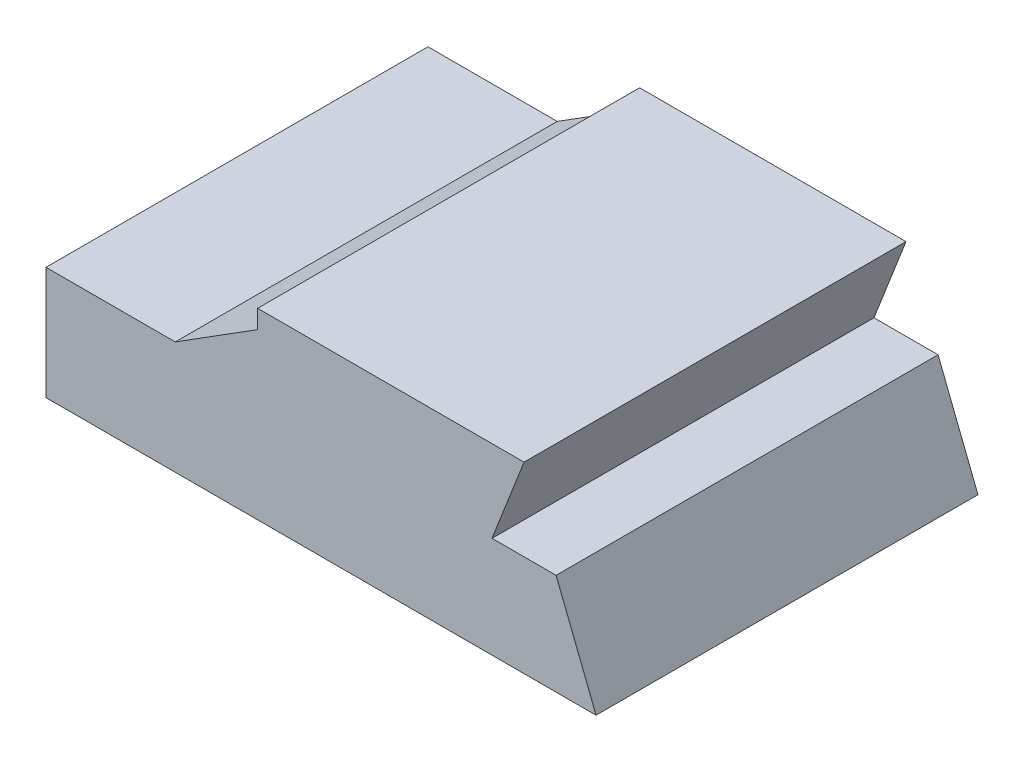
ISO-10303-21;
HEADER;
FILE_DESCRIPTION(('STEP AP214'),'2;1');
FILE_NAME('part.step','',(''),(''),'','','');
FILE_SCHEMA(('AUTOMOTIVE_DESIGN { 1 0 10303 214 1 1 1 1 }'));
ENDSEC;
DATA;
#1=APPLICATION_CONTEXT('core data for automotive mechanical design processes');
#2=APPLICATION_PROTOCOL_DEFINITION('international standard','automotive_design',2000,#1);
#3=PRODUCT_CONTEXT('',#1,'mechanical');
#4=PRODUCT('Part','Part','',(#3));
#5=PRODUCT_RELATED_PRODUCT_CATEGORY('part','',(#4));
#6=PRODUCT_DEFINITION_FORMATION('','',#4);
#7=PRODUCT_DEFINITION_CONTEXT('part definition',#1,'design');
#8=PRODUCT_DEFINITION('design','',#6,#7);
#9=PRODUCT_DEFINITION_SHAPE('','',#8);
#10=(LENGTH_UNIT() NAMED_UNIT(*) SI_UNIT(.MILLI.,.METRE.));
#11=(NAMED_UNIT(*) PLANE_ANGLE_UNIT() SI_UNIT($,.RADIAN.));
#12=(NAMED_UNIT(*) SI_UNIT($,.STERADIAN.) SOLID_ANGLE_UNIT());
#13=UNCERTAINTY_MEASURE_WITH_UNIT(LENGTH_MEASURE(1.E-05),#10,'distance_accuracy_value','');
#14=(GEOMETRIC_REPRESENTATION_CONTEXT(3) GLOBAL_UNCERTAINTY_ASSIGNED_CONTEXT((#13)) GLOBAL_UNIT_ASSIGNED_CONTEXT((#10,
#11,#12)) REPRESENTATION_CONTEXT('',''));
#15=CARTESIAN_POINT('',(0.,0.,0.));
#16=DIRECTION('',(0.,0.,1.));
#17=DIRECTION('',(1.,0.,0.));
#18=AXIS2_PLACEMENT_3D('',#15,#16,#17);
#19=CARTESIAN_POINT('',(125.156200350633,47.9623912919101,-50.01));
#20=DIRECTION('',(0.,1.,0.));
#21=DIRECTION('',(0.,0.,1.));
#22=AXIS2_PLACEMENT_3D('',#19,#20,#21);
#23=PLANE('',#22);
#24=DIRECTION('',(0.,0.,-1.));
#25=VECTOR('',#24,1.);
#26=CARTESIAN_POINT('',(125.156200350633,47.9623912919101,50.));
#27=LINE('',#26,#25);
#28=CARTESIAN_POINT('',(125.156200350633,47.9623912919101,50.));
#29=VERTEX_POINT('',#28);
#30=CARTESIAN_POINT('',(125.156200350633,47.9623912919101,-50.));
#31=VERTEX_POINT('',#30);
#32=EDGE_CURVE('E216',#29,#31,#27,.T.);
#33=ORIENTED_EDGE('',*,*,#32,.T.);
#34=DIRECTION('',(-1.,0.,0.));
#35=VECTOR('',#34,1.);
#36=CARTESIAN_POINT('',(0.,47.9623912919101,-50.));
#37=LINE('',#36,#35);
#38=CARTESIAN_POINT('',(55.4044049790674,47.9623912919101,-50.));
#39=VERTEX_POINT('',#38);
#40=EDGE_CURVE('E213',#31,#39,#37,.T.);
#41=ORIENTED_EDGE('',*,*,#40,.T.);
#42=DIRECTION('',(0.,0.,-1.));
#43=VECTOR('',#42,1.);
#44=CARTESIAN_POINT('',(55.4044049790674,47.9623912919101,50.));
#45=LINE('',#44,#43);
#46=CARTESIAN_POINT('',(55.4044049790674,47.9623912919101,50.));
#47=VERTEX_POINT('',#46);
#48=EDGE_CURVE('E207',#47,#39,#45,.T.);
#49=ORIENTED_EDGE('',*,*,#48,.F.);
#50=DIRECTION('',(-1.,0.,0.));
#51=VECTOR('',#50,1.);
#52=CARTESIAN_POINT('',(0.,47.9623912919101,50.));
#53=LINE('',#52,#51);
#54=EDGE_CURVE('E210',#29,#47,#53,.T.);
#55=ORIENTED_EDGE('',*,*,#54,.F.);
#56=EDGE_LOOP('',(#33,#41,#49,#55));
#57=FACE_BOUND('',#56,.T.);
#58=ADVANCED_FACE('F92',(#57),#23,.T.);
#59=CARTESIAN_POINT('',(0.,0.,-50.));
#60=DIRECTION('',(0.,0.,1.));
#61=DIRECTION('',(1.,0.,0.));
#62=AXIS2_PLACEMENT_3D('',#59,#60,#61);
#63=PLANE('',#62);
#64=ORIENTED_EDGE('',*,*,#40,.F.);
#65=DIRECTION('',(0.363850527140363,0.931457349479664,0.));
#66=VECTOR('',#65,1.);
#67=CARTESIAN_POINT('',(92.3321267886473,-36.0672370268024,-50.));
#68=LINE('',#67,#66);
#69=CARTESIAN_POINT('',(116.770080258154,26.4939238551565,-50.));
#70=VERTEX_POINT('',#69);
#71=EDGE_CURVE('E218',#70,#31,#68,.T.);
#72=ORIENTED_EDGE('',*,*,#71,.F.);
#73=DIRECTION('',(-1.,0.,0.));
#74=VECTOR('',#73,1.);
#75=CARTESIAN_POINT('',(0.,26.4939238551565,-50.));
#76=LINE('',#75,#74);
#77=CARTESIAN_POINT('',(133.542320443112,26.4939238551565,-50.));
#78=VERTEX_POINT('',#77);
#79=EDGE_CURVE('E146',#78,#70,#76,.T.);
#80=ORIENTED_EDGE('',*,*,#79,.F.);
#81=DIRECTION('',(-0.367183293175132,0.930148605983509,0.));
#82=VECTOR('',#81,1.);
#83=CARTESIAN_POINT('',(124.586270983111,49.1813856083972,-50.));
#84=LINE('',#83,#82);
#85=CARTESIAN_POINT('',(144.001,0.,-50.));
#86=VERTEX_POINT('',#85);
#87=EDGE_CURVE('E186',#86,#78,#84,.T.);
#88=ORIENTED_EDGE('',*,*,#87,.F.);
#89=DIRECTION('',(1.,0.,0.));
#90=VECTOR('',#89,1.);
#91=CARTESIAN_POINT('',(0.,0.,-50.));
#92=LINE('',#91,#90);
#93=CARTESIAN_POINT('',(0.,0.,-50.));
#94=VERTEX_POINT('',#93);
#95=EDGE_CURVE('E184',#94,#86,#92,.T.);
#96=ORIENTED_EDGE('',*,*,#95,.F.);
#97=DIRECTION('',(0.,1.,0.));
#98=VECTOR('',#97,1.);
#99=CARTESIAN_POINT('',(0.,0.,-50.));
#100=LINE('',#99,#98);
#101=CARTESIAN_POINT('',(0.,29.5569477873395,-50.));
#102=VERTEX_POINT('',#101);
#103=EDGE_CURVE('E166',#94,#102,#100,.T.);
#104=ORIENTED_EDGE('',*,*,#103,.T.);
#105=DIRECTION('',(1.,0.,0.));
#106=VECTOR('',#105,1.);
#107=CARTESIAN_POINT('',(0.,29.5569477873395,-50.));
#108=LINE('',#107,#106);
#109=CARTESIAN_POINT('',(33.8411284964257,29.5569477873395,-50.));
#110=VERTEX_POINT('',#109);
#111=EDGE_CURVE('E175',#102,#110,#108,.T.);
#112=ORIENTED_EDGE('',*,*,#111,.T.);
#113=DIRECTION('',(0.846232840089753,0.532813269686136,0.));
#114=VECTOR('',#113,1.);
#115=CARTESIAN_POINT('',(-3.71960009717276,5.90760015433326,-50.));
#116=LINE('',#115,#114);
#117=CARTESIAN_POINT('',(55.4044049790674,43.1338255727064,-50.));
#118=VERTEX_POINT('',#117);
#119=EDGE_CURVE('E101',#110,#118,#116,.T.);
#120=ORIENTED_EDGE('',*,*,#119,.T.);
#121=DIRECTION('',(0.,1.,0.));
#122=VECTOR('',#121,1.);
#123=CARTESIAN_POINT('',(55.4044049790674,0.,-50.));
#124=LINE('',#123,#122);
#125=EDGE_CURVE('E12',#118,#39,#124,.T.);
#126=ORIENTED_EDGE('',*,*,#125,.T.);
#127=EDGE_LOOP('',(#64,#72,#80,#88,#96,#104,#112,#120,#126));
#128=FACE_BOUND('',#127,.T.);
#129=ADVANCED_FACE('F182',(#128),#63,.F.);
#130=CARTESIAN_POINT('',(0.,0.,50.));
#131=DIRECTION('',(0.,0.,1.));
#132=DIRECTION('',(1.,0.,0.));
#133=AXIS2_PLACEMENT_3D('',#130,#131,#132);
#134=PLANE('',#133);
#135=DIRECTION('',(0.363850527140363,0.931457349479664,0.));
#136=VECTOR('',#135,1.);
#137=CARTESIAN_POINT('',(92.3321267886473,-36.0672370268024,50.));
#138=LINE('',#137,#136);
#139=CARTESIAN_POINT('',(116.770080258154,26.4939238551565,50.));
#140=VERTEX_POINT('',#139);
#141=EDGE_CURVE('E191',#140,#29,#138,.T.);
#142=ORIENTED_EDGE('',*,*,#141,.T.);
#143=ORIENTED_EDGE('',*,*,#54,.T.);
#144=DIRECTION('',(0.,1.,0.));
#145=VECTOR('',#144,1.);
#146=CARTESIAN_POINT('',(55.4044049790674,0.,50.));
#147=LINE('',#146,#145);
#148=CARTESIAN_POINT('',(55.4044049790674,43.1338255727064,50.));
#149=VERTEX_POINT('',#148);
#150=EDGE_CURVE('E206',#149,#47,#147,.T.);
#151=ORIENTED_EDGE('',*,*,#150,.F.);
#152=DIRECTION('',(0.846232840089753,0.532813269686136,0.));
#153=VECTOR('',#152,1.);
#154=CARTESIAN_POINT('',(-3.71960009717276,5.90760015433326,50.));
#155=LINE('',#154,#153);
#156=CARTESIAN_POINT('',(33.8411284964257,29.5569477873395,50.));
#157=VERTEX_POINT('',#156);
#158=EDGE_CURVE('E204',#157,#149,#155,.T.);
#159=ORIENTED_EDGE('',*,*,#158,.F.);
#160=DIRECTION('',(1.,0.,0.));
#161=VECTOR('',#160,1.);
#162=CARTESIAN_POINT('',(0.,29.5569477873395,50.));
#163=LINE('',#162,#161);
#164=CARTESIAN_POINT('',(0.,29.5569477873395,50.));
#165=VERTEX_POINT('',#164);
#166=EDGE_CURVE('E202',#165,#157,#163,.T.);
#167=ORIENTED_EDGE('',*,*,#166,.F.);
#168=DIRECTION('',(0.,1.,0.));
#169=VECTOR('',#168,1.);
#170=CARTESIAN_POINT('',(0.,0.,50.));
#171=LINE('',#170,#169);
#172=CARTESIAN_POINT('',(0.,0.,50.));
#173=VERTEX_POINT('',#172);
#174=EDGE_CURVE('E168',#173,#165,#171,.T.);
#175=ORIENTED_EDGE('',*,*,#174,.F.);
#176=DIRECTION('',(1.,0.,0.));
#177=VECTOR('',#176,1.);
#178=CARTESIAN_POINT('',(0.,0.,50.));
#179=LINE('',#178,#177);
#180=CARTESIAN_POINT('',(144.001,0.,50.));
#181=VERTEX_POINT('',#180);
#182=EDGE_CURVE('E199',#173,#181,#179,.T.);
#183=ORIENTED_EDGE('',*,*,#182,.T.);
#184=DIRECTION('',(-0.367183293175132,0.930148605983509,0.));
#185=VECTOR('',#184,1.);
#186=CARTESIAN_POINT('',(124.586270983111,49.1813856083972,50.));
#187=LINE('',#186,#185);
#188=CARTESIAN_POINT('',(133.542320443112,26.4939238551565,50.));
#189=VERTEX_POINT('',#188);
#190=EDGE_CURVE('E197',#181,#189,#187,.T.);
#191=ORIENTED_EDGE('',*,*,#190,.T.);
#192=DIRECTION('',(-1.,0.,0.));
#193=VECTOR('',#192,1.);
#194=CARTESIAN_POINT('',(0.,26.4939238551565,50.));
#195=LINE('',#194,#193);
#196=EDGE_CURVE('E194',#189,#140,#195,.T.);
#197=ORIENTED_EDGE('',*,*,#196,.T.);
#198=EDGE_LOOP('',(#142,#143,#151,#159,#167,#175,#183,#191,#197));
#199=FACE_BOUND('',#198,.T.);
#200=ADVANCED_FACE('F256',(#199),#134,.T.);
#201=CARTESIAN_POINT('',(55.4044049790674,0.,50.));
#202=DIRECTION('',(-1.,0.,0.));
#203=DIRECTION('',(0.,-1.,0.));
#204=AXIS2_PLACEMENT_3D('',#201,#202,#203);
#205=PLANE('',#204);
#206=ORIENTED_EDGE('',*,*,#150,.T.);
#207=ORIENTED_EDGE('',*,*,#48,.T.);
#208=ORIENTED_EDGE('',*,*,#125,.F.);
#209=DIRECTION('',(0.,0.,-1.));
#210=VECTOR('',#209,1.);
#211=CARTESIAN_POINT('',(55.4044049790674,43.1338255727064,50.));
#212=LINE('',#211,#210);
#213=EDGE_CURVE('E109',#149,#118,#212,.T.);
#214=ORIENTED_EDGE('',*,*,#213,.F.);
#215=EDGE_LOOP('',(#206,#207,#208,#214));
#216=FACE_BOUND('',#215,.T.);
#217=ADVANCED_FACE('F94',(#216),#205,.T.);
#218=CARTESIAN_POINT('',(-3.71960009717276,5.90760015433326,50.));
#219=DIRECTION('',(-0.532813269686136,0.846232840089753,0.));
#220=DIRECTION('',(-0.846232840089753,-0.532813269686136,0.));
#221=AXIS2_PLACEMENT_3D('',#218,#219,#220);
#222=PLANE('',#221);
#223=ORIENTED_EDGE('',*,*,#119,.F.);
#224=DIRECTION('',(0.,0.,-1.));
#225=VECTOR('',#224,1.);
#226=CARTESIAN_POINT('',(33.8411284964257,29.5569477873395,50.));
#227=LINE('',#226,#225);
#228=EDGE_CURVE('E133',#157,#110,#227,.T.);
#229=ORIENTED_EDGE('',*,*,#228,.F.);
#230=ORIENTED_EDGE('',*,*,#158,.T.);
#231=ORIENTED_EDGE('',*,*,#213,.T.);
#232=EDGE_LOOP('',(#223,#229,#230,#231));
#233=FACE_BOUND('',#232,.T.);
#234=ADVANCED_FACE('F248',(#233),#222,.T.);
#235=CARTESIAN_POINT('',(0.,29.5569477873395,50.));
#236=DIRECTION('',(0.,1.,0.));
#237=DIRECTION('',(0.,0.,1.));
#238=AXIS2_PLACEMENT_3D('',#235,#236,#237);
#239=PLANE('',#238);
#240=ORIENTED_EDGE('',*,*,#111,.F.);
#241=DIRECTION('',(0.,0.,-1.));
#242=VECTOR('',#241,1.);
#243=CARTESIAN_POINT('',(0.,29.5569477873395,50.));
#244=LINE('',#243,#242);
#245=EDGE_CURVE('E162',#165,#102,#244,.T.);
#246=ORIENTED_EDGE('',*,*,#245,.F.);
#247=ORIENTED_EDGE('',*,*,#166,.T.);
#248=ORIENTED_EDGE('',*,*,#228,.T.);
#249=EDGE_LOOP('',(#240,#246,#247,#248));
#250=FACE_BOUND('',#249,.T.);
#251=ADVANCED_FACE('F176',(#250),#239,.T.);
#252=CARTESIAN_POINT('',(0.,0.,50.));
#253=DIRECTION('',(-1.,0.,0.));
#254=DIRECTION('',(0.,0.,1.));
#255=AXIS2_PLACEMENT_3D('',#252,#253,#254);
#256=PLANE('',#255);
#257=ORIENTED_EDGE('',*,*,#103,.F.);
#258=DIRECTION('',(0.,0.,-1.));
#259=VECTOR('',#258,1.);
#260=CARTESIAN_POINT('',(0.,0.,50.));
#261=LINE('',#260,#259);
#262=EDGE_CURVE('E172',#173,#94,#261,.T.);
#263=ORIENTED_EDGE('',*,*,#262,.F.);
#264=ORIENTED_EDGE('',*,*,#174,.T.);
#265=ORIENTED_EDGE('',*,*,#245,.T.);
#266=EDGE_LOOP('',(#257,#263,#264,#265));
#267=FACE_BOUND('',#266,.T.);
#268=ADVANCED_FACE('F164',(#267),#256,.T.);
#269=CARTESIAN_POINT('',(0.,0.,50.));
#270=DIRECTION('',(0.,1.,0.));
#271=DIRECTION('',(0.,0.,1.));
#272=AXIS2_PLACEMENT_3D('',#269,#270,#271);
#273=PLANE('',#272);
#274=ORIENTED_EDGE('',*,*,#95,.T.);
#275=DIRECTION('',(0.,0.,-1.));
#276=VECTOR('',#275,1.);
#277=CARTESIAN_POINT('',(144.001,0.,50.));
#278=LINE('',#277,#276);
#279=EDGE_CURVE('E237',#181,#86,#278,.T.);
#280=ORIENTED_EDGE('',*,*,#279,.F.);
#281=ORIENTED_EDGE('',*,*,#182,.F.);
#282=ORIENTED_EDGE('',*,*,#262,.T.);
#283=EDGE_LOOP('',(#274,#280,#281,#282));
#284=FACE_BOUND('',#283,.T.);
#285=ADVANCED_FACE('F271',(#284),#273,.F.);
#286=CARTESIAN_POINT('',(124.586270983111,49.1813856083972,50.));
#287=DIRECTION('',(-0.930148605983509,-0.367183293175132,0.));
#288=DIRECTION('',(0.367183293175132,-0.930148605983509,0.));
#289=AXIS2_PLACEMENT_3D('',#286,#287,#288);
#290=PLANE('',#289);
#291=ORIENTED_EDGE('',*,*,#87,.T.);
#292=DIRECTION('',(0.,0.,-1.));
#293=VECTOR('',#292,1.);
#294=CARTESIAN_POINT('',(133.542320443112,26.4939238551565,50.));
#295=LINE('',#294,#293);
#296=EDGE_CURVE('E234',#189,#78,#295,.T.);
#297=ORIENTED_EDGE('',*,*,#296,.F.);
#298=ORIENTED_EDGE('',*,*,#190,.F.);
#299=ORIENTED_EDGE('',*,*,#279,.T.);
#300=EDGE_LOOP('',(#291,#297,#298,#299));
#301=FACE_BOUND('',#300,.T.);
#302=ADVANCED_FACE('F232',(#301),#290,.F.);
#303=CARTESIAN_POINT('',(0.,26.4939238551565,50.));
#304=DIRECTION('',(0.,-1.,0.));
#305=DIRECTION('',(0.,0.,-1.));
#306=AXIS2_PLACEMENT_3D('',#303,#304,#305);
#307=PLANE('',#306);
#308=ORIENTED_EDGE('',*,*,#79,.T.);
#309=DIRECTION('',(0.,0.,-1.));
#310=VECTOR('',#309,1.);
#311=CARTESIAN_POINT('',(116.770080258154,26.4939238551565,50.));
#312=LINE('',#311,#310);
#313=EDGE_CURVE('E195',#140,#70,#312,.T.);
#314=ORIENTED_EDGE('',*,*,#313,.F.);
#315=ORIENTED_EDGE('',*,*,#196,.F.);
#316=ORIENTED_EDGE('',*,*,#296,.T.);
#317=EDGE_LOOP('',(#308,#314,#315,#316));
#318=FACE_BOUND('',#317,.T.);
#319=ADVANCED_FACE('F238',(#318),#307,.F.);
#320=CARTESIAN_POINT('',(92.3321267886473,-36.0672370268024,50.));
#321=DIRECTION('',(-0.931457349479664,0.363850527140362,0.));
#322=DIRECTION('',(-0.363850527140363,-0.931457349479664,0.));
#323=AXIS2_PLACEMENT_3D('',#320,#321,#322);
#324=PLANE('',#323);
#325=ORIENTED_EDGE('',*,*,#71,.T.);
#326=ORIENTED_EDGE('',*,*,#32,.F.);
#327=ORIENTED_EDGE('',*,*,#141,.F.);
#328=ORIENTED_EDGE('',*,*,#313,.T.);
#329=EDGE_LOOP('',(#325,#326,#327,#328));
#330=FACE_BOUND('',#329,.T.);
#331=ADVANCED_FACE('F245',(#330),#324,.F.);
#332=CLOSED_SHELL('',(#58,#129,#200,#217,#234,#251,#268,#285,#302,#319,#331));
#333=MANIFOLD_SOLID_BREP('B2',#332);
#334=ADVANCED_BREP_SHAPE_REPRESENTATION('',(#18,#333),#14);
#335=SHAPE_DEFINITION_REPRESENTATION(#9,#334);
ENDSEC;
END-ISO-10303-21;
